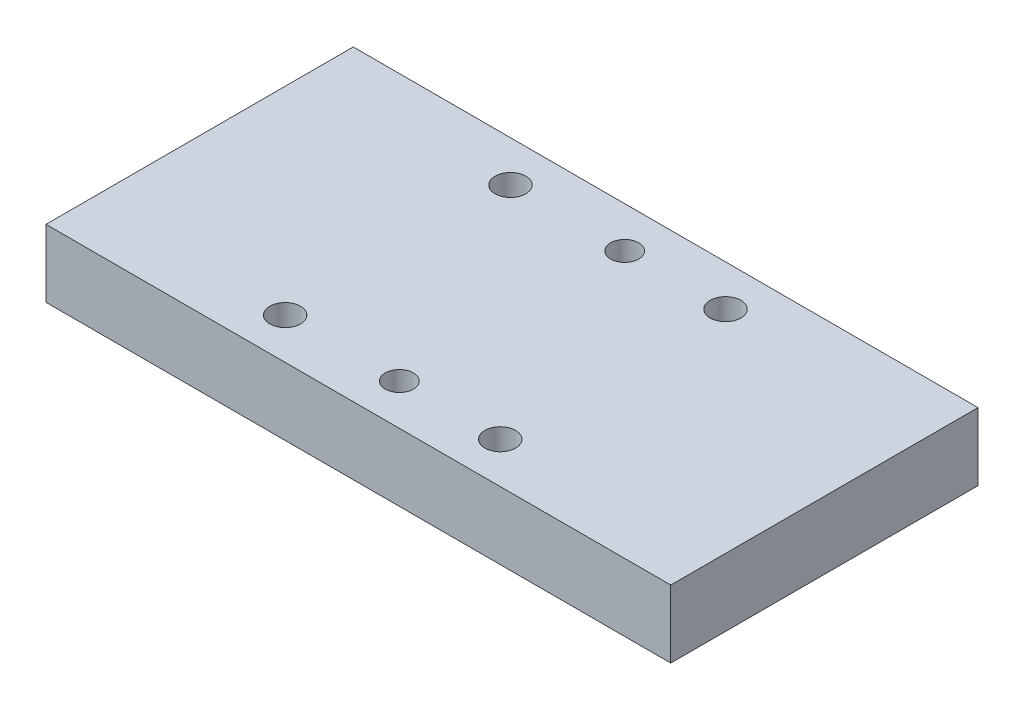
ISO-10303-21;
HEADER;
FILE_DESCRIPTION(('STEP AP214'),'2;1');
FILE_NAME('part.step','',(''),(''),'','','');
FILE_SCHEMA(('AUTOMOTIVE_DESIGN { 1 0 10303 214 1 1 1 1 }'));
ENDSEC;
DATA;
#1=APPLICATION_CONTEXT('core data for automotive mechanical design processes');
#2=APPLICATION_PROTOCOL_DEFINITION('international standard','automotive_design',2000,#1);
#3=PRODUCT_CONTEXT('',#1,'mechanical');
#4=PRODUCT('Part','Part','',(#3));
#5=PRODUCT_RELATED_PRODUCT_CATEGORY('part','',(#4));
#6=PRODUCT_DEFINITION_FORMATION('','',#4);
#7=PRODUCT_DEFINITION_CONTEXT('part definition',#1,'design');
#8=PRODUCT_DEFINITION('design','',#6,#7);
#9=PRODUCT_DEFINITION_SHAPE('','',#8);
#10=(LENGTH_UNIT() NAMED_UNIT(*) SI_UNIT(.MILLI.,.METRE.));
#11=(NAMED_UNIT(*) PLANE_ANGLE_UNIT() SI_UNIT($,.RADIAN.));
#12=(NAMED_UNIT(*) SI_UNIT($,.STERADIAN.) SOLID_ANGLE_UNIT());
#13=UNCERTAINTY_MEASURE_WITH_UNIT(LENGTH_MEASURE(1.E-05),#10,'distance_accuracy_value','');
#14=(GEOMETRIC_REPRESENTATION_CONTEXT(3) GLOBAL_UNCERTAINTY_ASSIGNED_CONTEXT((#13)) GLOBAL_UNIT_ASSIGNED_CONTEXT((#10,
#11,#12)) REPRESENTATION_CONTEXT('',''));
#15=CARTESIAN_POINT('',(0.,0.,0.));
#16=DIRECTION('',(0.,0.,1.));
#17=DIRECTION('',(1.,0.,0.));
#18=AXIS2_PLACEMENT_3D('',#15,#16,#17);
#19=CARTESIAN_POINT('',(0.,13.2,0.));
#20=DIRECTION('',(0.,1.,0.));
#21=DIRECTION('',(0.,0.,1.));
#22=AXIS2_PLACEMENT_3D('',#19,#20,#21);
#23=PLANE('',#22);
#24=CARTESIAN_POINT('',(0.,13.2,22.));
#25=DIRECTION('',(0.,1.,0.));
#26=DIRECTION('',(0.,0.,1.));
#27=AXIS2_PLACEMENT_3D('',#24,#25,#26);
#28=CIRCLE('',#27,2.75);
#29=CARTESIAN_POINT('',(0.,13.2,24.75));
#30=VERTEX_POINT('',#29);
#31=EDGE_CURVE('E140',#30,#30,#28,.T.);
#32=ORIENTED_EDGE('',*,*,#31,.F.);
#33=EDGE_LOOP('',(#32));
#34=FACE_BOUND('',#33,.T.);
#35=CARTESIAN_POINT('',(-22.3018867924528,13.2,22.));
#36=DIRECTION('',(0.,1.,0.));
#37=DIRECTION('',(0.,0.,1.));
#38=AXIS2_PLACEMENT_3D('',#35,#36,#37);
#39=CIRCLE('',#38,3.);
#40=CARTESIAN_POINT('',(-22.3018867924528,13.2,25.));
#41=VERTEX_POINT('',#40);
#42=EDGE_CURVE('E128',#41,#41,#39,.T.);
#43=ORIENTED_EDGE('',*,*,#42,.F.);
#44=EDGE_LOOP('',(#43));
#45=FACE_BOUND('',#44,.T.);
#46=CARTESIAN_POINT('',(19.6981132075472,13.2,-22.));
#47=DIRECTION('',(0.,1.,0.));
#48=DIRECTION('',(0.,0.,1.));
#49=AXIS2_PLACEMENT_3D('',#46,#47,#48);
#50=CIRCLE('',#49,3.);
#51=CARTESIAN_POINT('',(19.6981132075472,13.2,-19.));
#52=VERTEX_POINT('',#51);
#53=EDGE_CURVE('E107',#52,#52,#50,.T.);
#54=ORIENTED_EDGE('',*,*,#53,.F.);
#55=EDGE_LOOP('',(#54));
#56=FACE_BOUND('',#55,.T.);
#57=DIRECTION('',(0.,0.,1.));
#58=VECTOR('',#57,1.);
#59=CARTESIAN_POINT('',(-61.,13.2,30.));
#60=LINE('',#59,#58);
#61=CARTESIAN_POINT('',(-61.,13.2,-30.));
#62=VERTEX_POINT('',#61);
#63=CARTESIAN_POINT('',(-61.,13.2,30.));
#64=VERTEX_POINT('',#63);
#65=EDGE_CURVE('E92',#62,#64,#60,.T.);
#66=ORIENTED_EDGE('',*,*,#65,.T.);
#67=DIRECTION('',(1.,0.,0.));
#68=VECTOR('',#67,1.);
#69=CARTESIAN_POINT('',(61.,13.2,30.));
#70=LINE('',#69,#68);
#71=CARTESIAN_POINT('',(61.,13.2,30.));
#72=VERTEX_POINT('',#71);
#73=EDGE_CURVE('E87',#64,#72,#70,.T.);
#74=ORIENTED_EDGE('',*,*,#73,.T.);
#75=DIRECTION('',(0.,0.,-1.));
#76=VECTOR('',#75,1.);
#77=CARTESIAN_POINT('',(61.,13.2,30.));
#78=LINE('',#77,#76);
#79=CARTESIAN_POINT('',(61.,13.2,-30.));
#80=VERTEX_POINT('',#79);
#81=EDGE_CURVE('E90',#72,#80,#78,.T.);
#82=ORIENTED_EDGE('',*,*,#81,.T.);
#83=DIRECTION('',(-1.,0.,0.));
#84=VECTOR('',#83,1.);
#85=CARTESIAN_POINT('',(61.,13.2,-30.));
#86=LINE('',#85,#84);
#87=EDGE_CURVE('E57',#80,#62,#86,.T.);
#88=ORIENTED_EDGE('',*,*,#87,.T.);
#89=EDGE_LOOP('',(#66,#74,#82,#88));
#90=FACE_BOUND('',#89,.T.);
#91=CARTESIAN_POINT('',(-22.3018867924528,13.2,-22.));
#92=DIRECTION('',(0.,1.,0.));
#93=DIRECTION('',(0.,0.,1.));
#94=AXIS2_PLACEMENT_3D('',#91,#92,#93);
#95=CIRCLE('',#94,3.);
#96=CARTESIAN_POINT('',(-22.3018867924528,13.2,-19.));
#97=VERTEX_POINT('',#96);
#98=EDGE_CURVE('E122',#97,#97,#95,.T.);
#99=ORIENTED_EDGE('',*,*,#98,.F.);
#100=EDGE_LOOP('',(#99));
#101=FACE_BOUND('',#100,.T.);
#102=CARTESIAN_POINT('',(19.6981132075472,13.2,22.));
#103=DIRECTION('',(0.,1.,0.));
#104=DIRECTION('',(0.,0.,1.));
#105=AXIS2_PLACEMENT_3D('',#102,#103,#104);
#106=CIRCLE('',#105,3.);
#107=CARTESIAN_POINT('',(19.6981132075472,13.2,25.));
#108=VERTEX_POINT('',#107);
#109=EDGE_CURVE('E134',#108,#108,#106,.T.);
#110=ORIENTED_EDGE('',*,*,#109,.F.);
#111=EDGE_LOOP('',(#110));
#112=FACE_BOUND('',#111,.T.);
#113=CARTESIAN_POINT('',(0.,13.2,-22.));
#114=DIRECTION('',(0.,1.,0.));
#115=DIRECTION('',(0.,0.,1.));
#116=AXIS2_PLACEMENT_3D('',#113,#114,#115);
#117=CIRCLE('',#116,2.75);
#118=CARTESIAN_POINT('',(0.,13.2,-19.25));
#119=VERTEX_POINT('',#118);
#120=EDGE_CURVE('E146',#119,#119,#117,.T.);
#121=ORIENTED_EDGE('',*,*,#120,.F.);
#122=EDGE_LOOP('',(#121));
#123=FACE_BOUND('',#122,.T.);
#124=ADVANCED_FACE('F40',(#34,#45,#56,#90,#101,#112,#123),#23,.T.);
#125=CARTESIAN_POINT('',(0.,0.,0.));
#126=DIRECTION('',(0.,1.,0.));
#127=DIRECTION('',(0.,0.,1.));
#128=AXIS2_PLACEMENT_3D('',#125,#126,#127);
#129=PLANE('',#128);
#130=DIRECTION('',(0.,0.,1.));
#131=VECTOR('',#130,1.);
#132=CARTESIAN_POINT('',(-61.,0.,30.));
#133=LINE('',#132,#131);
#134=CARTESIAN_POINT('',(-61.,0.,-30.));
#135=VERTEX_POINT('',#134);
#136=CARTESIAN_POINT('',(-61.,0.,30.));
#137=VERTEX_POINT('',#136);
#138=EDGE_CURVE('E104',#135,#137,#133,.T.);
#139=ORIENTED_EDGE('',*,*,#138,.F.);
#140=DIRECTION('',(-1.,0.,0.));
#141=VECTOR('',#140,1.);
#142=CARTESIAN_POINT('',(61.,0.,-30.));
#143=LINE('',#142,#141);
#144=CARTESIAN_POINT('',(61.,0.,-30.));
#145=VERTEX_POINT('',#144);
#146=EDGE_CURVE('E80',#145,#135,#143,.T.);
#147=ORIENTED_EDGE('',*,*,#146,.F.);
#148=DIRECTION('',(0.,0.,-1.));
#149=VECTOR('',#148,1.);
#150=CARTESIAN_POINT('',(61.,0.,30.));
#151=LINE('',#150,#149);
#152=CARTESIAN_POINT('',(61.,0.,30.));
#153=VERTEX_POINT('',#152);
#154=EDGE_CURVE('E74',#153,#145,#151,.T.);
#155=ORIENTED_EDGE('',*,*,#154,.F.);
#156=DIRECTION('',(1.,0.,0.));
#157=VECTOR('',#156,1.);
#158=CARTESIAN_POINT('',(61.,0.,30.));
#159=LINE('',#158,#157);
#160=EDGE_CURVE('E96',#137,#153,#159,.T.);
#161=ORIENTED_EDGE('',*,*,#160,.F.);
#162=EDGE_LOOP('',(#139,#147,#155,#161));
#163=FACE_BOUND('',#162,.T.);
#164=CARTESIAN_POINT('',(19.6981132075472,0.,-22.));
#165=DIRECTION('',(0.,1.,0.));
#166=DIRECTION('',(0.,0.,1.));
#167=AXIS2_PLACEMENT_3D('',#164,#165,#166);
#168=CIRCLE('',#167,3.);
#169=CARTESIAN_POINT('',(19.6981132075472,0.,-19.));
#170=VERTEX_POINT('',#169);
#171=EDGE_CURVE('E119',#170,#170,#168,.T.);
#172=ORIENTED_EDGE('',*,*,#171,.T.);
#173=EDGE_LOOP('',(#172));
#174=FACE_BOUND('',#173,.T.);
#175=CARTESIAN_POINT('',(-22.3018867924528,0.,-22.));
#176=DIRECTION('',(0.,1.,0.));
#177=DIRECTION('',(0.,0.,1.));
#178=AXIS2_PLACEMENT_3D('',#175,#176,#177);
#179=CIRCLE('',#178,3.);
#180=CARTESIAN_POINT('',(-22.3018867924528,0.,-19.));
#181=VERTEX_POINT('',#180);
#182=EDGE_CURVE('E125',#181,#181,#179,.T.);
#183=ORIENTED_EDGE('',*,*,#182,.T.);
#184=EDGE_LOOP('',(#183));
#185=FACE_BOUND('',#184,.T.);
#186=CARTESIAN_POINT('',(-22.3018867924528,0.,22.));
#187=DIRECTION('',(0.,1.,0.));
#188=DIRECTION('',(0.,0.,1.));
#189=AXIS2_PLACEMENT_3D('',#186,#187,#188);
#190=CIRCLE('',#189,3.);
#191=CARTESIAN_POINT('',(-22.3018867924528,0.,25.));
#192=VERTEX_POINT('',#191);
#193=EDGE_CURVE('E131',#192,#192,#190,.T.);
#194=ORIENTED_EDGE('',*,*,#193,.T.);
#195=EDGE_LOOP('',(#194));
#196=FACE_BOUND('',#195,.T.);
#197=CARTESIAN_POINT('',(19.6981132075472,0.,22.));
#198=DIRECTION('',(0.,1.,0.));
#199=DIRECTION('',(0.,0.,1.));
#200=AXIS2_PLACEMENT_3D('',#197,#198,#199);
#201=CIRCLE('',#200,3.);
#202=CARTESIAN_POINT('',(19.6981132075472,0.,25.));
#203=VERTEX_POINT('',#202);
#204=EDGE_CURVE('E137',#203,#203,#201,.T.);
#205=ORIENTED_EDGE('',*,*,#204,.T.);
#206=EDGE_LOOP('',(#205));
#207=FACE_BOUND('',#206,.T.);
#208=CARTESIAN_POINT('',(0.,0.,22.));
#209=DIRECTION('',(0.,1.,0.));
#210=DIRECTION('',(0.,0.,1.));
#211=AXIS2_PLACEMENT_3D('',#208,#209,#210);
#212=CIRCLE('',#211,2.75);
#213=CARTESIAN_POINT('',(0.,0.,24.75));
#214=VERTEX_POINT('',#213);
#215=EDGE_CURVE('E143',#214,#214,#212,.T.);
#216=ORIENTED_EDGE('',*,*,#215,.T.);
#217=EDGE_LOOP('',(#216));
#218=FACE_BOUND('',#217,.T.);
#219=CARTESIAN_POINT('',(0.,0.,-22.));
#220=DIRECTION('',(0.,1.,0.));
#221=DIRECTION('',(0.,0.,1.));
#222=AXIS2_PLACEMENT_3D('',#219,#220,#221);
#223=CIRCLE('',#222,2.75);
#224=CARTESIAN_POINT('',(0.,0.,-19.25));
#225=VERTEX_POINT('',#224);
#226=EDGE_CURVE('E149',#225,#225,#223,.T.);
#227=ORIENTED_EDGE('',*,*,#226,.T.);
#228=EDGE_LOOP('',(#227));
#229=FACE_BOUND('',#228,.T.);
#230=ADVANCED_FACE('F115',(#163,#174,#185,#196,#207,#218,#229),#129,.F.);
#231=CARTESIAN_POINT('',(-61.,13.2,30.));
#232=DIRECTION('',(1.,0.,0.));
#233=DIRECTION('',(0.,0.,-1.));
#234=AXIS2_PLACEMENT_3D('',#231,#232,#233);
#235=PLANE('',#234);
#236=ORIENTED_EDGE('',*,*,#138,.T.);
#237=DIRECTION('',(0.,-1.,0.));
#238=VECTOR('',#237,1.);
#239=CARTESIAN_POINT('',(-61.,13.2,30.));
#240=LINE('',#239,#238);
#241=EDGE_CURVE('E11',#64,#137,#240,.T.);
#242=ORIENTED_EDGE('',*,*,#241,.F.);
#243=ORIENTED_EDGE('',*,*,#65,.F.);
#244=DIRECTION('',(0.,-1.,0.));
#245=VECTOR('',#244,1.);
#246=CARTESIAN_POINT('',(-61.,13.2,-30.));
#247=LINE('',#246,#245);
#248=EDGE_CURVE('E100',#62,#135,#247,.T.);
#249=ORIENTED_EDGE('',*,*,#248,.T.);
#250=EDGE_LOOP('',(#236,#242,#243,#249));
#251=FACE_BOUND('',#250,.T.);
#252=ADVANCED_FACE('F42',(#251),#235,.F.);
#253=CARTESIAN_POINT('',(61.,13.2,30.));
#254=DIRECTION('',(0.,0.,-1.));
#255=DIRECTION('',(-1.,0.,0.));
#256=AXIS2_PLACEMENT_3D('',#253,#254,#255);
#257=PLANE('',#256);
#258=ORIENTED_EDGE('',*,*,#160,.T.);
#259=DIRECTION('',(0.,-1.,0.));
#260=VECTOR('',#259,1.);
#261=CARTESIAN_POINT('',(61.,13.2,30.));
#262=LINE('',#261,#260);
#263=EDGE_CURVE('E49',#72,#153,#262,.T.);
#264=ORIENTED_EDGE('',*,*,#263,.F.);
#265=ORIENTED_EDGE('',*,*,#73,.F.);
#266=ORIENTED_EDGE('',*,*,#241,.T.);
#267=EDGE_LOOP('',(#258,#264,#265,#266));
#268=FACE_BOUND('',#267,.T.);
#269=ADVANCED_FACE('F95',(#268),#257,.F.);
#270=CARTESIAN_POINT('',(61.,13.2,30.));
#271=DIRECTION('',(-1.,0.,0.));
#272=DIRECTION('',(0.,0.,1.));
#273=AXIS2_PLACEMENT_3D('',#270,#271,#272);
#274=PLANE('',#273);
#275=ORIENTED_EDGE('',*,*,#154,.T.);
#276=DIRECTION('',(0.,-1.,0.));
#277=VECTOR('',#276,1.);
#278=CARTESIAN_POINT('',(61.,13.2,-30.));
#279=LINE('',#278,#277);
#280=EDGE_CURVE('E97',#80,#145,#279,.T.);
#281=ORIENTED_EDGE('',*,*,#280,.F.);
#282=ORIENTED_EDGE('',*,*,#81,.F.);
#283=ORIENTED_EDGE('',*,*,#263,.T.);
#284=EDGE_LOOP('',(#275,#281,#282,#283));
#285=FACE_BOUND('',#284,.T.);
#286=ADVANCED_FACE('F98',(#285),#274,.F.);
#287=CARTESIAN_POINT('',(61.,13.2,-30.));
#288=DIRECTION('',(0.,0.,1.));
#289=DIRECTION('',(1.,0.,0.));
#290=AXIS2_PLACEMENT_3D('',#287,#288,#289);
#291=PLANE('',#290);
#292=ORIENTED_EDGE('',*,*,#146,.T.);
#293=ORIENTED_EDGE('',*,*,#248,.F.);
#294=ORIENTED_EDGE('',*,*,#87,.F.);
#295=ORIENTED_EDGE('',*,*,#280,.T.);
#296=EDGE_LOOP('',(#292,#293,#294,#295));
#297=FACE_BOUND('',#296,.T.);
#298=ADVANCED_FACE('F112',(#297),#291,.F.);
#299=CARTESIAN_POINT('',(19.6981132075472,13.2,-22.));
#300=DIRECTION('',(0.,-1.,0.));
#301=DIRECTION('',(0.,0.,-1.));
#302=AXIS2_PLACEMENT_3D('',#299,#300,#301);
#303=CYLINDRICAL_SURFACE('',#302,3.);
#304=ORIENTED_EDGE('',*,*,#53,.T.);
#305=EDGE_LOOP('',(#304));
#306=FACE_BOUND('',#305,.T.);
#307=ORIENTED_EDGE('',*,*,#171,.F.);
#308=EDGE_LOOP('',(#307));
#309=FACE_BOUND('',#308,.T.);
#310=ADVANCED_FACE('F168',(#306,#309),#303,.F.);
#311=CARTESIAN_POINT('',(-22.3018867924528,13.2,-22.));
#312=DIRECTION('',(0.,-1.,0.));
#313=DIRECTION('',(0.,0.,-1.));
#314=AXIS2_PLACEMENT_3D('',#311,#312,#313);
#315=CYLINDRICAL_SURFACE('',#314,3.);
#316=ORIENTED_EDGE('',*,*,#98,.T.);
#317=EDGE_LOOP('',(#316));
#318=FACE_BOUND('',#317,.T.);
#319=ORIENTED_EDGE('',*,*,#182,.F.);
#320=EDGE_LOOP('',(#319));
#321=FACE_BOUND('',#320,.T.);
#322=ADVANCED_FACE('F236',(#318,#321),#315,.F.);
#323=CARTESIAN_POINT('',(-22.3018867924528,13.2,22.));
#324=DIRECTION('',(0.,-1.,0.));
#325=DIRECTION('',(0.,0.,-1.));
#326=AXIS2_PLACEMENT_3D('',#323,#324,#325);
#327=CYLINDRICAL_SURFACE('',#326,3.);
#328=ORIENTED_EDGE('',*,*,#42,.T.);
#329=EDGE_LOOP('',(#328));
#330=FACE_BOUND('',#329,.T.);
#331=ORIENTED_EDGE('',*,*,#193,.F.);
#332=EDGE_LOOP('',(#331));
#333=FACE_BOUND('',#332,.T.);
#334=ADVANCED_FACE('F247',(#330,#333),#327,.F.);
#335=CARTESIAN_POINT('',(19.6981132075472,13.2,22.));
#336=DIRECTION('',(0.,-1.,0.));
#337=DIRECTION('',(0.,0.,-1.));
#338=AXIS2_PLACEMENT_3D('',#335,#336,#337);
#339=CYLINDRICAL_SURFACE('',#338,3.);
#340=ORIENTED_EDGE('',*,*,#109,.T.);
#341=EDGE_LOOP('',(#340));
#342=FACE_BOUND('',#341,.T.);
#343=ORIENTED_EDGE('',*,*,#204,.F.);
#344=EDGE_LOOP('',(#343));
#345=FACE_BOUND('',#344,.T.);
#346=ADVANCED_FACE('F258',(#342,#345),#339,.F.);
#347=CARTESIAN_POINT('',(0.,13.2,22.));
#348=DIRECTION('',(0.,-1.,0.));
#349=DIRECTION('',(0.,0.,-1.));
#350=AXIS2_PLACEMENT_3D('',#347,#348,#349);
#351=CYLINDRICAL_SURFACE('',#350,2.75);
#352=ORIENTED_EDGE('',*,*,#31,.T.);
#353=EDGE_LOOP('',(#352));
#354=FACE_BOUND('',#353,.T.);
#355=ORIENTED_EDGE('',*,*,#215,.F.);
#356=EDGE_LOOP('',(#355));
#357=FACE_BOUND('',#356,.T.);
#358=ADVANCED_FACE('F270',(#354,#357),#351,.F.);
#359=CARTESIAN_POINT('',(0.,13.2,-22.));
#360=DIRECTION('',(0.,-1.,0.));
#361=DIRECTION('',(0.,0.,-1.));
#362=AXIS2_PLACEMENT_3D('',#359,#360,#361);
#363=CYLINDRICAL_SURFACE('',#362,2.75);
#364=ORIENTED_EDGE('',*,*,#120,.T.);
#365=EDGE_LOOP('',(#364));
#366=FACE_BOUND('',#365,.T.);
#367=ORIENTED_EDGE('',*,*,#226,.F.);
#368=EDGE_LOOP('',(#367));
#369=FACE_BOUND('',#368,.T.);
#370=ADVANCED_FACE('F155',(#366,#369),#363,.F.);
#371=CLOSED_SHELL('',(#124,#230,#252,#269,#286,#298,#310,#322,#334,#346,#358,#370));
#372=MANIFOLD_SOLID_BREP('B2',#371);
#373=ADVANCED_BREP_SHAPE_REPRESENTATION('',(#18,#372),#14);
#374=SHAPE_DEFINITION_REPRESENTATION(#9,#373);
ENDSEC;
END-ISO-10303-21;
